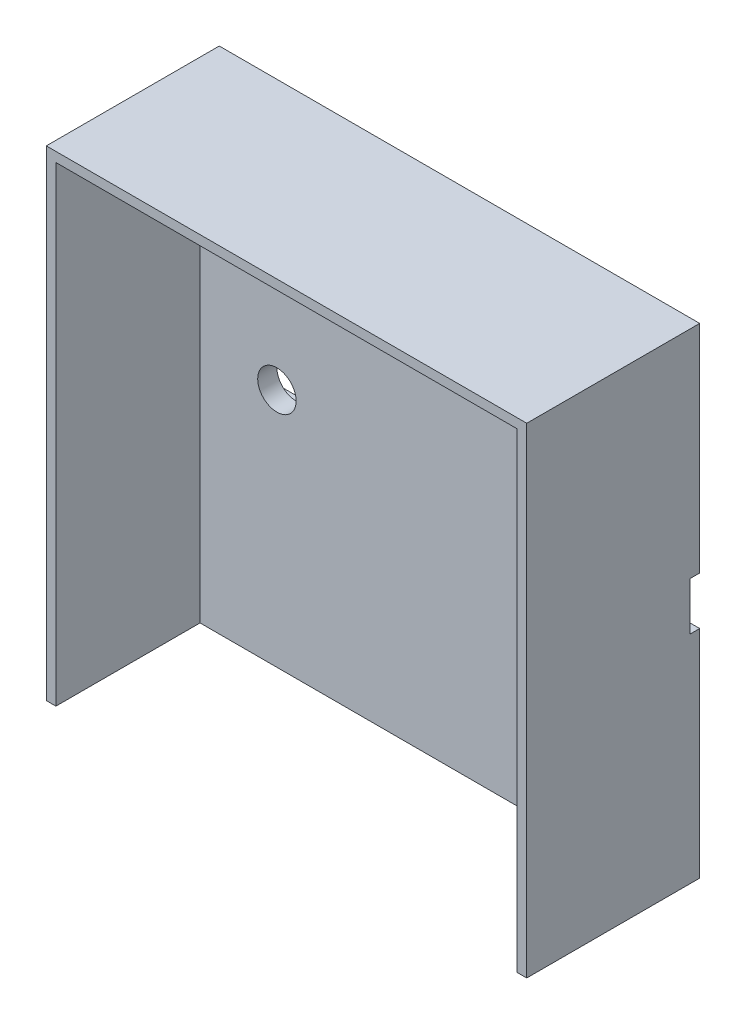
ISO-10303-21;
HEADER;
FILE_DESCRIPTION(('STEP AP214'),'2;1');
FILE_NAME('part.step','',(''),(''),'','','');
FILE_SCHEMA(('AUTOMOTIVE_DESIGN { 1 0 10303 214 1 1 1 1 }'));
ENDSEC;
DATA;
#1=APPLICATION_CONTEXT('core data for automotive mechanical design processes');
#2=APPLICATION_PROTOCOL_DEFINITION('international standard','automotive_design',2000,#1);
#3=PRODUCT_CONTEXT('',#1,'mechanical');
#4=PRODUCT('Part','Part','',(#3));
#5=PRODUCT_RELATED_PRODUCT_CATEGORY('part','',(#4));
#6=PRODUCT_DEFINITION_FORMATION('','',#4);
#7=PRODUCT_DEFINITION_CONTEXT('part definition',#1,'design');
#8=PRODUCT_DEFINITION('design','',#6,#7);
#9=PRODUCT_DEFINITION_SHAPE('','',#8);
#10=(LENGTH_UNIT() NAMED_UNIT(*) SI_UNIT(.MILLI.,.METRE.));
#11=(NAMED_UNIT(*) PLANE_ANGLE_UNIT() SI_UNIT($,.RADIAN.));
#12=(NAMED_UNIT(*) SI_UNIT($,.STERADIAN.) SOLID_ANGLE_UNIT());
#13=UNCERTAINTY_MEASURE_WITH_UNIT(LENGTH_MEASURE(1.E-05),#10,'distance_accuracy_value','');
#14=(GEOMETRIC_REPRESENTATION_CONTEXT(3) GLOBAL_UNCERTAINTY_ASSIGNED_CONTEXT((#13)) GLOBAL_UNIT_ASSIGNED_CONTEXT((#10,
#11,#12)) REPRESENTATION_CONTEXT('',''));
#15=CARTESIAN_POINT('',(0.,0.,0.));
#16=DIRECTION('',(0.,0.,1.));
#17=DIRECTION('',(1.,0.,0.));
#18=AXIS2_PLACEMENT_3D('',#15,#16,#17);
#19=CARTESIAN_POINT('',(0.,0.,3.));
#20=DIRECTION('',(0.,0.,1.));
#21=DIRECTION('',(1.,0.,0.));
#22=AXIS2_PLACEMENT_3D('',#19,#20,#21);
#23=PLANE('',#22);
#24=CARTESIAN_POINT('',(16.,0.,3.));
#25=DIRECTION('',(0.,0.,1.));
#26=DIRECTION('',(1.,0.,0.));
#27=AXIS2_PLACEMENT_3D('',#24,#25,#26);
#28=CIRCLE('',#27,2.);
#29=CARTESIAN_POINT('',(18.,0.,3.));
#30=VERTEX_POINT('',#29);
#31=EDGE_CURVE('E231',#30,#30,#28,.T.);
#32=ORIENTED_EDGE('',*,*,#31,.F.);
#33=EDGE_LOOP('',(#32));
#34=FACE_BOUND('',#33,.T.);
#35=CARTESIAN_POINT('',(-16.,0.,3.));
#36=DIRECTION('',(0.,0.,1.));
#37=DIRECTION('',(1.,0.,0.));
#38=AXIS2_PLACEMENT_3D('',#35,#36,#37);
#39=CIRCLE('',#38,2.);
#40=CARTESIAN_POINT('',(-14.,0.,3.));
#41=VERTEX_POINT('',#40);
#42=EDGE_CURVE('E305',#41,#41,#39,.T.);
#43=ORIENTED_EDGE('',*,*,#42,.F.);
#44=EDGE_LOOP('',(#43));
#45=FACE_BOUND('',#44,.T.);
#46=DIRECTION('',(1.,0.,0.));
#47=VECTOR('',#46,1.);
#48=CARTESIAN_POINT('',(0.,24.,3.));
#49=LINE('',#48,#47);
#50=CARTESIAN_POINT('',(-24.,24.,3.));
#51=VERTEX_POINT('',#50);
#52=CARTESIAN_POINT('',(24.,24.,3.));
#53=VERTEX_POINT('',#52);
#54=EDGE_CURVE('E54',#51,#53,#49,.T.);
#55=ORIENTED_EDGE('',*,*,#54,.F.);
#56=DIRECTION('',(0.,-1.,0.));
#57=VECTOR('',#56,1.);
#58=CARTESIAN_POINT('',(-24.,0.,3.));
#59=LINE('',#58,#57);
#60=CARTESIAN_POINT('',(-24.,-25.,3.));
#61=VERTEX_POINT('',#60);
#62=EDGE_CURVE('E145',#51,#61,#59,.T.);
#63=ORIENTED_EDGE('',*,*,#62,.T.);
#64=DIRECTION('',(-1.,0.,0.));
#65=VECTOR('',#64,1.);
#66=CARTESIAN_POINT('',(25.,-25.,3.));
#67=LINE('',#66,#65);
#68=CARTESIAN_POINT('',(24.,-25.,3.));
#69=VERTEX_POINT('',#68);
#70=EDGE_CURVE('E180',#69,#61,#67,.T.);
#71=ORIENTED_EDGE('',*,*,#70,.F.);
#72=DIRECTION('',(0.,-1.,0.));
#73=VECTOR('',#72,1.);
#74=CARTESIAN_POINT('',(24.,0.,3.));
#75=LINE('',#74,#73);
#76=EDGE_CURVE('E59',#53,#69,#75,.T.);
#77=ORIENTED_EDGE('',*,*,#76,.F.);
#78=EDGE_LOOP('',(#55,#63,#71,#77));
#79=FACE_BOUND('',#78,.T.);
#80=ADVANCED_FACE('F37',(#34,#45,#79),#23,.T.);
#81=CARTESIAN_POINT('',(25.,25.,3.));
#82=DIRECTION('',(1.,0.,0.));
#83=DIRECTION('',(0.,1.,0.));
#84=AXIS2_PLACEMENT_3D('',#81,#82,#83);
#85=PLANE('',#84);
#86=DIRECTION('',(0.,-1.,0.));
#87=VECTOR('',#86,1.);
#88=CARTESIAN_POINT('',(25.,2.5,1.));
#89=LINE('',#88,#87);
#90=CARTESIAN_POINT('',(25.,2.5,1.));
#91=VERTEX_POINT('',#90);
#92=CARTESIAN_POINT('',(25.,-2.5,1.));
#93=VERTEX_POINT('',#92);
#94=EDGE_CURVE('E156',#91,#93,#89,.T.);
#95=ORIENTED_EDGE('',*,*,#94,.F.);
#96=DIRECTION('',(0.,0.,-1.));
#97=VECTOR('',#96,1.);
#98=CARTESIAN_POINT('',(25.,2.5,1.));
#99=LINE('',#98,#97);
#100=CARTESIAN_POINT('',(25.,2.5,0.));
#101=VERTEX_POINT('',#100);
#102=EDGE_CURVE('E170',#91,#101,#99,.T.);
#103=ORIENTED_EDGE('',*,*,#102,.T.);
#104=DIRECTION('',(0.,-1.,0.));
#105=VECTOR('',#104,1.);
#106=CARTESIAN_POINT('',(25.,25.,0.));
#107=LINE('',#106,#105);
#108=CARTESIAN_POINT('',(25.,25.,0.));
#109=VERTEX_POINT('',#108);
#110=EDGE_CURVE('E183',#109,#101,#107,.T.);
#111=ORIENTED_EDGE('',*,*,#110,.F.);
#112=DIRECTION('',(0.,0.,-1.));
#113=VECTOR('',#112,1.);
#114=CARTESIAN_POINT('',(25.,25.,3.));
#115=LINE('',#114,#113);
#116=CARTESIAN_POINT('',(25.,25.,18.));
#117=VERTEX_POINT('',#116);
#118=EDGE_CURVE('E46',#117,#109,#115,.T.);
#119=ORIENTED_EDGE('',*,*,#118,.F.);
#120=DIRECTION('',(0.,1.,0.));
#121=VECTOR('',#120,1.);
#122=CARTESIAN_POINT('',(25.,0.,18.));
#123=LINE('',#122,#121);
#124=CARTESIAN_POINT('',(25.,-25.,18.));
#125=VERTEX_POINT('',#124);
#126=EDGE_CURVE('E218',#125,#117,#123,.T.);
#127=ORIENTED_EDGE('',*,*,#126,.F.);
#128=DIRECTION('',(0.,0.,-1.));
#129=VECTOR('',#128,1.);
#130=CARTESIAN_POINT('',(25.,-25.,3.));
#131=LINE('',#130,#129);
#132=CARTESIAN_POINT('',(25.,-25.,0.));
#133=VERTEX_POINT('',#132);
#134=EDGE_CURVE('E11',#125,#133,#131,.T.);
#135=ORIENTED_EDGE('',*,*,#134,.T.);
#136=CARTESIAN_POINT('',(25.,-2.5,0.));
#137=VERTEX_POINT('',#136);
#138=EDGE_CURVE('E192',#137,#133,#107,.T.);
#139=ORIENTED_EDGE('',*,*,#138,.F.);
#140=DIRECTION('',(0.,0.,-1.));
#141=VECTOR('',#140,1.);
#142=CARTESIAN_POINT('',(25.,-2.5,1.));
#143=LINE('',#142,#141);
#144=EDGE_CURVE('E166',#93,#137,#143,.T.);
#145=ORIENTED_EDGE('',*,*,#144,.F.);
#146=EDGE_LOOP('',(#95,#103,#111,#119,#127,#135,#139,#145));
#147=FACE_BOUND('',#146,.T.);
#148=ADVANCED_FACE('F216',(#147),#85,.T.);
#149=CARTESIAN_POINT('',(-25.,25.,3.));
#150=DIRECTION('',(1.,0.,0.));
#151=DIRECTION('',(0.,1.,0.));
#152=AXIS2_PLACEMENT_3D('',#149,#150,#151);
#153=PLANE('',#152);
#154=DIRECTION('',(0.,0.,-1.));
#155=VECTOR('',#154,1.);
#156=CARTESIAN_POINT('',(-25.,2.5,1.));
#157=LINE('',#156,#155);
#158=CARTESIAN_POINT('',(-25.,2.5,1.));
#159=VERTEX_POINT('',#158);
#160=CARTESIAN_POINT('',(-25.,2.5,0.));
#161=VERTEX_POINT('',#160);
#162=EDGE_CURVE('E174',#159,#161,#157,.T.);
#163=ORIENTED_EDGE('',*,*,#162,.F.);
#164=DIRECTION('',(0.,-1.,0.));
#165=VECTOR('',#164,1.);
#166=CARTESIAN_POINT('',(-25.,2.5,1.));
#167=LINE('',#166,#165);
#168=CARTESIAN_POINT('',(-25.,-2.5,1.));
#169=VERTEX_POINT('',#168);
#170=EDGE_CURVE('E162',#159,#169,#167,.T.);
#171=ORIENTED_EDGE('',*,*,#170,.T.);
#172=DIRECTION('',(0.,0.,-1.));
#173=VECTOR('',#172,1.);
#174=CARTESIAN_POINT('',(-25.,-2.5,1.));
#175=LINE('',#174,#173);
#176=CARTESIAN_POINT('',(-25.,-2.5,0.));
#177=VERTEX_POINT('',#176);
#178=EDGE_CURVE('E176',#169,#177,#175,.T.);
#179=ORIENTED_EDGE('',*,*,#178,.T.);
#180=DIRECTION('',(0.,-1.,0.));
#181=VECTOR('',#180,1.);
#182=CARTESIAN_POINT('',(-25.,25.,0.));
#183=LINE('',#182,#181);
#184=CARTESIAN_POINT('',(-25.,-25.,0.));
#185=VERTEX_POINT('',#184);
#186=EDGE_CURVE('E186',#177,#185,#183,.T.);
#187=ORIENTED_EDGE('',*,*,#186,.T.);
#188=DIRECTION('',(0.,0.,-1.));
#189=VECTOR('',#188,1.);
#190=CARTESIAN_POINT('',(-25.,-25.,3.));
#191=LINE('',#190,#189);
#192=CARTESIAN_POINT('',(-25.,-25.,18.));
#193=VERTEX_POINT('',#192);
#194=EDGE_CURVE('E41',#193,#185,#191,.T.);
#195=ORIENTED_EDGE('',*,*,#194,.F.);
#196=DIRECTION('',(0.,-1.,0.));
#197=VECTOR('',#196,1.);
#198=CARTESIAN_POINT('',(-25.,0.,18.));
#199=LINE('',#198,#197);
#200=CARTESIAN_POINT('',(-25.,25.,18.));
#201=VERTEX_POINT('',#200);
#202=EDGE_CURVE('E224',#201,#193,#199,.T.);
#203=ORIENTED_EDGE('',*,*,#202,.F.);
#204=DIRECTION('',(0.,0.,-1.));
#205=VECTOR('',#204,1.);
#206=CARTESIAN_POINT('',(-25.,25.,3.));
#207=LINE('',#206,#205);
#208=CARTESIAN_POINT('',(-25.,25.,0.));
#209=VERTEX_POINT('',#208);
#210=EDGE_CURVE('E195',#201,#209,#207,.T.);
#211=ORIENTED_EDGE('',*,*,#210,.T.);
#212=EDGE_CURVE('E187',#209,#161,#183,.T.);
#213=ORIENTED_EDGE('',*,*,#212,.T.);
#214=EDGE_LOOP('',(#163,#171,#179,#187,#195,#203,#211,#213));
#215=FACE_BOUND('',#214,.T.);
#216=ADVANCED_FACE('F244',(#215),#153,.F.);
#217=CARTESIAN_POINT('',(0.,0.,0.));
#218=DIRECTION('',(0.,0.,1.));
#219=DIRECTION('',(1.,0.,0.));
#220=AXIS2_PLACEMENT_3D('',#217,#218,#219);
#221=PLANE('',#220);
#222=DIRECTION('',(-1.,0.,0.));
#223=VECTOR('',#222,1.);
#224=CARTESIAN_POINT('',(25.,2.5,0.));
#225=LINE('',#224,#223);
#226=EDGE_CURVE('E150',#101,#161,#225,.T.);
#227=ORIENTED_EDGE('',*,*,#226,.T.);
#228=ORIENTED_EDGE('',*,*,#212,.F.);
#229=DIRECTION('',(-1.,0.,0.));
#230=VECTOR('',#229,1.);
#231=CARTESIAN_POINT('',(25.,25.,0.));
#232=LINE('',#231,#230);
#233=EDGE_CURVE('E190',#109,#209,#232,.T.);
#234=ORIENTED_EDGE('',*,*,#233,.F.);
#235=ORIENTED_EDGE('',*,*,#110,.T.);
#236=EDGE_LOOP('',(#227,#228,#234,#235));
#237=FACE_BOUND('',#236,.T.);
#238=ADVANCED_FACE('F255',(#237),#221,.F.);
#239=CARTESIAN_POINT('',(25.,-25.,3.));
#240=DIRECTION('',(0.,-1.,0.));
#241=DIRECTION('',(1.,0.,0.));
#242=AXIS2_PLACEMENT_3D('',#239,#240,#241);
#243=PLANE('',#242);
#244=DIRECTION('',(-1.,0.,0.));
#245=VECTOR('',#244,1.);
#246=CARTESIAN_POINT('',(25.,-25.,0.));
#247=LINE('',#246,#245);
#248=EDGE_CURVE('E173',#133,#185,#247,.T.);
#249=ORIENTED_EDGE('',*,*,#248,.F.);
#250=ORIENTED_EDGE('',*,*,#134,.F.);
#251=DIRECTION('',(1.,0.,0.));
#252=VECTOR('',#251,1.);
#253=CARTESIAN_POINT('',(0.,-25.,18.));
#254=LINE('',#253,#252);
#255=CARTESIAN_POINT('',(24.,-25.,18.));
#256=VERTEX_POINT('',#255);
#257=EDGE_CURVE('E136',#256,#125,#254,.T.);
#258=ORIENTED_EDGE('',*,*,#257,.F.);
#259=DIRECTION('',(0.,0.,-1.));
#260=VECTOR('',#259,1.);
#261=CARTESIAN_POINT('',(24.,-25.,18.));
#262=LINE('',#261,#260);
#263=EDGE_CURVE('E132',#256,#69,#262,.T.);
#264=ORIENTED_EDGE('',*,*,#263,.T.);
#265=ORIENTED_EDGE('',*,*,#70,.T.);
#266=DIRECTION('',(0.,0.,-1.));
#267=VECTOR('',#266,1.);
#268=CARTESIAN_POINT('',(-24.,-25.,18.));
#269=LINE('',#268,#267);
#270=CARTESIAN_POINT('',(-24.,-25.,18.));
#271=VERTEX_POINT('',#270);
#272=EDGE_CURVE('E152',#271,#61,#269,.T.);
#273=ORIENTED_EDGE('',*,*,#272,.F.);
#274=EDGE_CURVE('E205',#193,#271,#254,.T.);
#275=ORIENTED_EDGE('',*,*,#274,.F.);
#276=ORIENTED_EDGE('',*,*,#194,.T.);
#277=EDGE_LOOP('',(#249,#250,#258,#264,#265,#273,#275,#276));
#278=FACE_BOUND('',#277,.T.);
#279=ADVANCED_FACE('F39',(#278),#243,.T.);
#280=CARTESIAN_POINT('',(25.,25.,3.));
#281=DIRECTION('',(0.,-1.,0.));
#282=DIRECTION('',(1.,0.,0.));
#283=AXIS2_PLACEMENT_3D('',#280,#281,#282);
#284=PLANE('',#283);
#285=ORIENTED_EDGE('',*,*,#233,.T.);
#286=ORIENTED_EDGE('',*,*,#210,.F.);
#287=DIRECTION('',(-1.,0.,0.));
#288=VECTOR('',#287,1.);
#289=CARTESIAN_POINT('',(0.,25.,18.));
#290=LINE('',#289,#288);
#291=EDGE_CURVE('E222',#117,#201,#290,.T.);
#292=ORIENTED_EDGE('',*,*,#291,.F.);
#293=ORIENTED_EDGE('',*,*,#118,.T.);
#294=EDGE_LOOP('',(#285,#286,#292,#293));
#295=FACE_BOUND('',#294,.T.);
#296=ADVANCED_FACE('F254',(#295),#284,.F.);
#297=ORIENTED_EDGE('',*,*,#186,.F.);
#298=DIRECTION('',(-1.,0.,0.));
#299=VECTOR('',#298,1.);
#300=CARTESIAN_POINT('',(25.,-2.5,0.));
#301=LINE('',#300,#299);
#302=EDGE_CURVE('E148',#137,#177,#301,.T.);
#303=ORIENTED_EDGE('',*,*,#302,.F.);
#304=ORIENTED_EDGE('',*,*,#138,.T.);
#305=ORIENTED_EDGE('',*,*,#248,.T.);
#306=EDGE_LOOP('',(#297,#303,#304,#305));
#307=FACE_BOUND('',#306,.T.);
#308=ADVANCED_FACE('F209',(#307),#221,.F.);
#309=CARTESIAN_POINT('',(25.,2.5,1.));
#310=DIRECTION('',(0.,-1.,0.));
#311=DIRECTION('',(0.,0.,-1.));
#312=AXIS2_PLACEMENT_3D('',#309,#310,#311);
#313=PLANE('',#312);
#314=ORIENTED_EDGE('',*,*,#226,.F.);
#315=ORIENTED_EDGE('',*,*,#102,.F.);
#316=DIRECTION('',(-1.,0.,0.));
#317=VECTOR('',#316,1.);
#318=CARTESIAN_POINT('',(25.,2.5,1.));
#319=LINE('',#318,#317);
#320=EDGE_CURVE('E165',#91,#159,#319,.T.);
#321=ORIENTED_EDGE('',*,*,#320,.T.);
#322=ORIENTED_EDGE('',*,*,#162,.T.);
#323=EDGE_LOOP('',(#314,#315,#321,#322));
#324=FACE_BOUND('',#323,.T.);
#325=ADVANCED_FACE('F253',(#324),#313,.T.);
#326=CARTESIAN_POINT('',(25.,-2.5,1.));
#327=DIRECTION('',(0.,-1.,0.));
#328=DIRECTION('',(0.,0.,-1.));
#329=AXIS2_PLACEMENT_3D('',#326,#327,#328);
#330=PLANE('',#329);
#331=ORIENTED_EDGE('',*,*,#302,.T.);
#332=ORIENTED_EDGE('',*,*,#178,.F.);
#333=DIRECTION('',(-1.,0.,0.));
#334=VECTOR('',#333,1.);
#335=CARTESIAN_POINT('',(25.,-2.5,1.));
#336=LINE('',#335,#334);
#337=EDGE_CURVE('E159',#93,#169,#336,.T.);
#338=ORIENTED_EDGE('',*,*,#337,.F.);
#339=ORIENTED_EDGE('',*,*,#144,.T.);
#340=EDGE_LOOP('',(#331,#332,#338,#339));
#341=FACE_BOUND('',#340,.T.);
#342=ADVANCED_FACE('F250',(#341),#330,.F.);
#343=CARTESIAN_POINT('',(0.,0.,1.));
#344=DIRECTION('',(0.,0.,-1.));
#345=DIRECTION('',(-1.,0.,0.));
#346=AXIS2_PLACEMENT_3D('',#343,#344,#345);
#347=PLANE('',#346);
#348=CARTESIAN_POINT('',(16.,0.,1.));
#349=DIRECTION('',(0.,0.,-1.));
#350=DIRECTION('',(-1.,0.,0.));
#351=AXIS2_PLACEMENT_3D('',#348,#349,#350);
#352=CIRCLE('',#351,2.);
#353=CARTESIAN_POINT('',(14.,0.,1.));
#354=VERTEX_POINT('',#353);
#355=EDGE_CURVE('E304',#354,#354,#352,.T.);
#356=ORIENTED_EDGE('',*,*,#355,.F.);
#357=EDGE_LOOP('',(#356));
#358=FACE_BOUND('',#357,.T.);
#359=CARTESIAN_POINT('',(-16.,0.,1.));
#360=DIRECTION('',(0.,0.,-1.));
#361=DIRECTION('',(-1.,0.,0.));
#362=AXIS2_PLACEMENT_3D('',#359,#360,#361);
#363=CIRCLE('',#362,2.);
#364=CARTESIAN_POINT('',(-18.,0.,1.));
#365=VERTEX_POINT('',#364);
#366=EDGE_CURVE('E306',#365,#365,#363,.T.);
#367=ORIENTED_EDGE('',*,*,#366,.F.);
#368=EDGE_LOOP('',(#367));
#369=FACE_BOUND('',#368,.T.);
#370=ORIENTED_EDGE('',*,*,#94,.T.);
#371=ORIENTED_EDGE('',*,*,#337,.T.);
#372=ORIENTED_EDGE('',*,*,#170,.F.);
#373=ORIENTED_EDGE('',*,*,#320,.F.);
#374=EDGE_LOOP('',(#370,#371,#372,#373));
#375=FACE_BOUND('',#374,.T.);
#376=ADVANCED_FACE('F271',(#358,#369,#375),#347,.T.);
#377=CARTESIAN_POINT('',(0.,24.,18.));
#378=DIRECTION('',(0.,1.,0.));
#379=DIRECTION('',(0.,0.,1.));
#380=AXIS2_PLACEMENT_3D('',#377,#378,#379);
#381=PLANE('',#380);
#382=ORIENTED_EDGE('',*,*,#54,.T.);
#383=DIRECTION('',(0.,0.,-1.));
#384=VECTOR('',#383,1.);
#385=CARTESIAN_POINT('',(24.,24.,18.));
#386=LINE('',#385,#384);
#387=CARTESIAN_POINT('',(24.,24.,18.));
#388=VERTEX_POINT('',#387);
#389=EDGE_CURVE('E130',#388,#53,#386,.T.);
#390=ORIENTED_EDGE('',*,*,#389,.F.);
#391=DIRECTION('',(1.,0.,0.));
#392=VECTOR('',#391,1.);
#393=CARTESIAN_POINT('',(0.,24.,18.));
#394=LINE('',#393,#392);
#395=CARTESIAN_POINT('',(-24.,24.,18.));
#396=VERTEX_POINT('',#395);
#397=EDGE_CURVE('E137',#396,#388,#394,.T.);
#398=ORIENTED_EDGE('',*,*,#397,.F.);
#399=DIRECTION('',(0.,0.,-1.));
#400=VECTOR('',#399,1.);
#401=CARTESIAN_POINT('',(-24.,24.,18.));
#402=LINE('',#401,#400);
#403=EDGE_CURVE('E225',#396,#51,#402,.T.);
#404=ORIENTED_EDGE('',*,*,#403,.T.);
#405=EDGE_LOOP('',(#382,#390,#398,#404));
#406=FACE_BOUND('',#405,.T.);
#407=ADVANCED_FACE('F147',(#406),#381,.F.);
#408=CARTESIAN_POINT('',(24.,0.,18.));
#409=DIRECTION('',(1.,0.,0.));
#410=DIRECTION('',(0.,0.,-1.));
#411=AXIS2_PLACEMENT_3D('',#408,#409,#410);
#412=PLANE('',#411);
#413=ORIENTED_EDGE('',*,*,#76,.T.);
#414=ORIENTED_EDGE('',*,*,#263,.F.);
#415=DIRECTION('',(0.,-1.,0.));
#416=VECTOR('',#415,1.);
#417=CARTESIAN_POINT('',(24.,0.,18.));
#418=LINE('',#417,#416);
#419=EDGE_CURVE('E126',#388,#256,#418,.T.);
#420=ORIENTED_EDGE('',*,*,#419,.F.);
#421=ORIENTED_EDGE('',*,*,#389,.T.);
#422=EDGE_LOOP('',(#413,#414,#420,#421));
#423=FACE_BOUND('',#422,.T.);
#424=ADVANCED_FACE('F128',(#423),#412,.F.);
#425=CARTESIAN_POINT('',(-24.,0.,18.));
#426=DIRECTION('',(1.,0.,0.));
#427=DIRECTION('',(0.,1.,0.));
#428=AXIS2_PLACEMENT_3D('',#425,#426,#427);
#429=PLANE('',#428);
#430=ORIENTED_EDGE('',*,*,#62,.F.);
#431=ORIENTED_EDGE('',*,*,#403,.F.);
#432=DIRECTION('',(0.,-1.,0.));
#433=VECTOR('',#432,1.);
#434=CARTESIAN_POINT('',(-24.,0.,18.));
#435=LINE('',#434,#433);
#436=EDGE_CURVE('E143',#396,#271,#435,.T.);
#437=ORIENTED_EDGE('',*,*,#436,.T.);
#438=ORIENTED_EDGE('',*,*,#272,.T.);
#439=EDGE_LOOP('',(#430,#431,#437,#438));
#440=FACE_BOUND('',#439,.T.);
#441=ADVANCED_FACE('F237',(#440),#429,.T.);
#442=CARTESIAN_POINT('',(0.,0.,18.));
#443=DIRECTION('',(0.,0.,1.));
#444=DIRECTION('',(1.,0.,0.));
#445=AXIS2_PLACEMENT_3D('',#442,#443,#444);
#446=PLANE('',#445);
#447=ORIENTED_EDGE('',*,*,#397,.T.);
#448=ORIENTED_EDGE('',*,*,#419,.T.);
#449=ORIENTED_EDGE('',*,*,#257,.T.);
#450=ORIENTED_EDGE('',*,*,#126,.T.);
#451=ORIENTED_EDGE('',*,*,#291,.T.);
#452=ORIENTED_EDGE('',*,*,#202,.T.);
#453=ORIENTED_EDGE('',*,*,#274,.T.);
#454=ORIENTED_EDGE('',*,*,#436,.F.);
#455=EDGE_LOOP('',(#447,#448,#449,#450,#451,#452,#453,#454));
#456=FACE_BOUND('',#455,.T.);
#457=ADVANCED_FACE('F141',(#456),#446,.T.);
#458=CARTESIAN_POINT('',(-16.,0.,5.));
#459=DIRECTION('',(0.,0.,-1.));
#460=DIRECTION('',(-1.,0.,0.));
#461=AXIS2_PLACEMENT_3D('',#458,#459,#460);
#462=CYLINDRICAL_SURFACE('',#461,2.);
#463=ORIENTED_EDGE('',*,*,#42,.T.);
#464=EDGE_LOOP('',(#463));
#465=FACE_BOUND('',#464,.T.);
#466=ORIENTED_EDGE('',*,*,#366,.T.);
#467=EDGE_LOOP('',(#466));
#468=FACE_BOUND('',#467,.T.);
#469=ADVANCED_FACE('F291',(#465,#468),#462,.F.);
#470=CARTESIAN_POINT('',(16.,0.,5.));
#471=DIRECTION('',(0.,0.,-1.));
#472=DIRECTION('',(-1.,0.,0.));
#473=AXIS2_PLACEMENT_3D('',#470,#471,#472);
#474=CYLINDRICAL_SURFACE('',#473,2.);
#475=ORIENTED_EDGE('',*,*,#31,.T.);
#476=EDGE_LOOP('',(#475));
#477=FACE_BOUND('',#476,.T.);
#478=ORIENTED_EDGE('',*,*,#355,.T.);
#479=EDGE_LOOP('',(#478));
#480=FACE_BOUND('',#479,.T.);
#481=ADVANCED_FACE('F294',(#477,#480),#474,.F.);
#482=CLOSED_SHELL('',(#80,#148,#216,#238,#279,#296,#308,#325,#342,#376,#407,#424,#441,#457,#469,#481));
#483=MANIFOLD_SOLID_BREP('B2',#482);
#484=ADVANCED_BREP_SHAPE_REPRESENTATION('',(#18,#483),#14);
#485=SHAPE_DEFINITION_REPRESENTATION(#9,#484);
ENDSEC;
END-ISO-10303-21;
